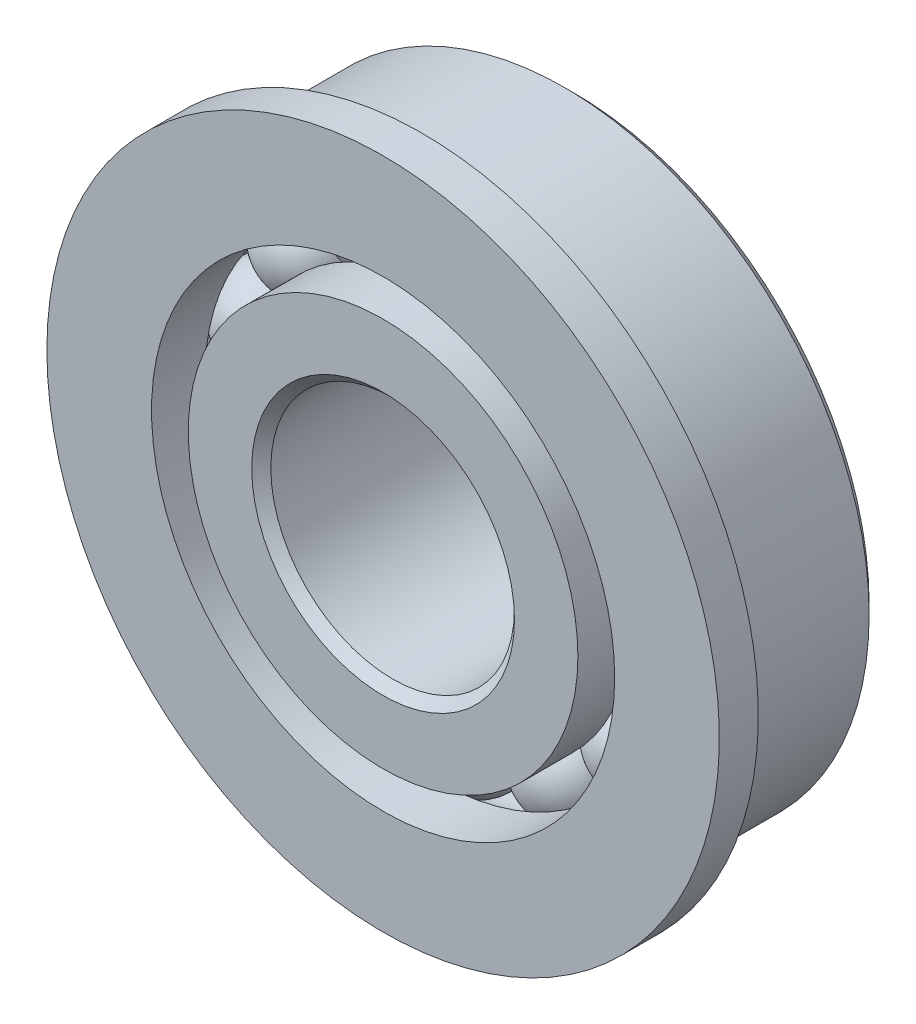
ISO-10303-21;
HEADER;
FILE_DESCRIPTION(('STEP AP214'),'2;1');
FILE_NAME('part.step','',(''),(''),'','','');
FILE_SCHEMA(('AUTOMOTIVE_DESIGN { 1 0 10303 214 1 1 1 1 }'));
ENDSEC;
DATA;
#1=APPLICATION_CONTEXT('core data for automotive mechanical design processes');
#2=APPLICATION_PROTOCOL_DEFINITION('international standard','automotive_design',2000,#1);
#3=PRODUCT_CONTEXT('',#1,'mechanical');
#4=PRODUCT('Part','Part','',(#3));
#5=PRODUCT_RELATED_PRODUCT_CATEGORY('part','',(#4));
#6=PRODUCT_DEFINITION_FORMATION('','',#4);
#7=PRODUCT_DEFINITION_CONTEXT('part definition',#1,'design');
#8=PRODUCT_DEFINITION('design','',#6,#7);
#9=PRODUCT_DEFINITION_SHAPE('','',#8);
#10=(LENGTH_UNIT() NAMED_UNIT(*) SI_UNIT(.MILLI.,.METRE.));
#11=(NAMED_UNIT(*) PLANE_ANGLE_UNIT() SI_UNIT($,.RADIAN.));
#12=(NAMED_UNIT(*) SI_UNIT($,.STERADIAN.) SOLID_ANGLE_UNIT());
#13=UNCERTAINTY_MEASURE_WITH_UNIT(LENGTH_MEASURE(1.E-05),#10,'distance_accuracy_value','');
#14=(GEOMETRIC_REPRESENTATION_CONTEXT(3) GLOBAL_UNCERTAINTY_ASSIGNED_CONTEXT((#13)) GLOBAL_UNIT_ASSIGNED_CONTEXT((#10,
#11,#12)) REPRESENTATION_CONTEXT('',''));
#15=CARTESIAN_POINT('',(0.,0.,0.));
#16=DIRECTION('',(0.,0.,1.));
#17=DIRECTION('',(1.,0.,0.));
#18=AXIS2_PLACEMENT_3D('',#15,#16,#17);
#19=CARTESIAN_POINT('',(2.41076652547194,5.00600827228281,0.));
#20=DIRECTION('',(0.,0.,-1.));
#21=DIRECTION('',(0.433883739117559,0.900968867902419,0.));
#22=AXIS2_PLACEMENT_3D('',#19,#20,#21);
#23=SPHERICAL_SURFACE('',#22,1.20554465033679);
#24=CARTESIAN_POINT('',(2.41076652547194,5.00600827228281,-1.20554465033679));
#25=VERTEX_POINT('',#24);
#26=VERTEX_LOOP('',#25);
#27=FACE_BOUND('',#26,.T.);
#28=ADVANCED_FACE('F35',(#27),#23,.T.);
#29=CLOSED_SHELL('',(#28));
#30=MANIFOLD_SOLID_BREP('B2',#29);
#31=CARTESIAN_POINT('',(0.,5.55625,0.));
#32=DIRECTION('',(0.,0.,-1.));
#33=DIRECTION('',(0.,1.,0.));
#34=AXIS2_PLACEMENT_3D('',#31,#32,#33);
#35=SPHERICAL_SURFACE('',#34,1.20554465033679);
#36=CARTESIAN_POINT('',(0.,5.55625,-1.20554465033679));
#37=VERTEX_POINT('',#36);
#38=VERTEX_LOOP('',#37);
#39=FACE_BOUND('',#38,.T.);
#40=ADVANCED_FACE('F53',(#39),#35,.T.);
#41=CLOSED_SHELL('',(#40));
#42=MANIFOLD_SOLID_BREP('B6',#41);
#43=CARTESIAN_POINT('',(-2.41076652547187,5.00600827228285,0.));
#44=DIRECTION('',(0.,0.,-1.));
#45=DIRECTION('',(-0.433883739117546,0.900968867902425,0.));
#46=AXIS2_PLACEMENT_3D('',#43,#44,#45);
#47=SPHERICAL_SURFACE('',#46,1.20554465033679);
#48=CARTESIAN_POINT('',(-2.41076652547187,5.00600827228285,-1.20554465033679));
#49=VERTEX_POINT('',#48);
#50=VERTEX_LOOP('',#49);
#51=FACE_BOUND('',#50,.T.);
#52=ADVANCED_FACE('F71',(#51),#47,.T.);
#53=CLOSED_SHELL('',(#52));
#54=MANIFOLD_SOLID_BREP('B31',#53);
#55=CARTESIAN_POINT('',(-4.34405117446295,3.46426521157764,0.));
#56=DIRECTION('',(0.,0.,-1.));
#57=DIRECTION('',(-0.781831482468022,0.623489801858743,0.));
#58=AXIS2_PLACEMENT_3D('',#55,#56,#57);
#59=SPHERICAL_SURFACE('',#58,1.20554465033679);
#60=CARTESIAN_POINT('',(-4.34405117446295,3.46426521157764,-1.20554465033679));
#61=VERTEX_POINT('',#60);
#62=VERTEX_LOOP('',#61);
#63=FACE_BOUND('',#62,.T.);
#64=ADVANCED_FACE('F89',(#63),#59,.T.);
#65=CLOSED_SHELL('',(#64));
#66=MANIFOLD_SOLID_BREP('B49',#65);
#67=CARTESIAN_POINT('',(-5.41694321206024,1.23638193929483,0.));
#68=DIRECTION('',(0.,0.,-1.));
#69=DIRECTION('',(-0.974927912181821,0.222520933956325,0.));
#70=AXIS2_PLACEMENT_3D('',#67,#68,#69);
#71=SPHERICAL_SURFACE('',#70,1.20554465033679);
#72=CARTESIAN_POINT('',(-5.41694321206024,1.23638193929483,-1.20554465033679));
#73=VERTEX_POINT('',#72);
#74=VERTEX_LOOP('',#73);
#75=FACE_BOUND('',#74,.T.);
#76=ADVANCED_FACE('F107',(#75),#71,.T.);
#77=CLOSED_SHELL('',(#76));
#78=MANIFOLD_SOLID_BREP('B67',#77);
#79=CARTESIAN_POINT('',(-5.41694321206027,-1.23638193929472,0.));
#80=DIRECTION('',(0.,0.,-1.));
#81=DIRECTION('',(-0.974927912181826,-0.222520933956305,0.));
#82=AXIS2_PLACEMENT_3D('',#79,#80,#81);
#83=SPHERICAL_SURFACE('',#82,1.20554465033679);
#84=CARTESIAN_POINT('',(-5.41694321206027,-1.23638193929472,-1.20554465033679));
#85=VERTEX_POINT('',#84);
#86=VERTEX_LOOP('',#85);
#87=FACE_BOUND('',#86,.T.);
#88=ADVANCED_FACE('F125',(#87),#83,.T.);
#89=CLOSED_SHELL('',(#88));
#90=MANIFOLD_SOLID_BREP('B85',#89);
#91=CARTESIAN_POINT('',(-4.34405117446302,-3.46426521157755,0.));
#92=DIRECTION('',(0.,0.,-1.));
#93=DIRECTION('',(-0.781831482468035,-0.623489801858727,0.));
#94=AXIS2_PLACEMENT_3D('',#91,#92,#93);
#95=SPHERICAL_SURFACE('',#94,1.20554465033679);
#96=CARTESIAN_POINT('',(-4.34405117446302,-3.46426521157755,-1.20554465033679));
#97=VERTEX_POINT('',#96);
#98=VERTEX_LOOP('',#97);
#99=FACE_BOUND('',#98,.T.);
#100=ADVANCED_FACE('F143',(#99),#95,.T.);
#101=CLOSED_SHELL('',(#100));
#102=MANIFOLD_SOLID_BREP('B103',#101);
#103=CARTESIAN_POINT('',(-2.41076652547197,-5.0060082722828,0.));
#104=DIRECTION('',(0.,0.,-1.));
#105=DIRECTION('',(-0.433883739117565,-0.900968867902416,0.));
#106=AXIS2_PLACEMENT_3D('',#103,#104,#105);
#107=SPHERICAL_SURFACE('',#106,1.20554465033679);
#108=CARTESIAN_POINT('',(-2.41076652547197,-5.0060082722828,-1.20554465033679));
#109=VERTEX_POINT('',#108);
#110=VERTEX_LOOP('',#109);
#111=FACE_BOUND('',#110,.T.);
#112=ADVANCED_FACE('F163',(#111),#107,.T.);
#113=CLOSED_SHELL('',(#112));
#114=MANIFOLD_SOLID_BREP('B121',#113);
#115=CARTESIAN_POINT('',(0.,0.,-2.24028));
#116=DIRECTION('',(0.,0.,1.));
#117=DIRECTION('',(-1.,0.,0.));
#118=AXIS2_PLACEMENT_3D('',#115,#116,#117);
#119=CONICAL_SURFACE('',#118,7.9375,0.785398163397448);
#120=CARTESIAN_POINT('',(0.,0.,-2.4892));
#121=DIRECTION('',(0.,0.,1.));
#122=DIRECTION('',(1.,0.,0.));
#123=AXIS2_PLACEMENT_3D('',#120,#121,#122);
#124=CIRCLE('',#123,7.68858);
#125=CARTESIAN_POINT('',(7.68858,0.,-2.4892));
#126=VERTEX_POINT('',#125);
#127=EDGE_CURVE('E203',#126,#126,#124,.T.);
#128=ORIENTED_EDGE('',*,*,#127,.T.);
#129=EDGE_LOOP('',(#128));
#130=FACE_BOUND('',#129,.T.);
#131=CARTESIAN_POINT('',(0.,0.,-2.24028));
#132=DIRECTION('',(0.,0.,1.));
#133=DIRECTION('',(1.,0.,0.));
#134=AXIS2_PLACEMENT_3D('',#131,#132,#133);
#135=CIRCLE('',#134,7.9375);
#136=CARTESIAN_POINT('',(7.9375,0.,-2.24028));
#137=VERTEX_POINT('',#136);
#138=EDGE_CURVE('E162',#137,#137,#135,.T.);
#139=ORIENTED_EDGE('',*,*,#138,.F.);
#140=EDGE_LOOP('',(#139));
#141=FACE_BOUND('',#140,.T.);
#142=ADVANCED_FACE('F181',(#130,#141),#119,.T.);
#143=CARTESIAN_POINT('',(0.,0.,-2.4892));
#144=DIRECTION('',(0.,0.,-1.));
#145=DIRECTION('',(1.,0.,0.));
#146=AXIS2_PLACEMENT_3D('',#143,#144,#145);
#147=CYLINDRICAL_SURFACE('',#146,7.9375);
#148=CARTESIAN_POINT('',(0.,0.,1.4732));
#149=DIRECTION('',(0.,0.,1.));
#150=DIRECTION('',(1.,0.,0.));
#151=AXIS2_PLACEMENT_3D('',#148,#149,#150);
#152=CIRCLE('',#151,7.9375);
#153=CARTESIAN_POINT('',(7.9375,0.,1.4732));
#154=VERTEX_POINT('',#153);
#155=EDGE_CURVE('E184',#154,#154,#152,.T.);
#156=ORIENTED_EDGE('',*,*,#155,.F.);
#157=EDGE_LOOP('',(#156));
#158=FACE_BOUND('',#157,.T.);
#159=ORIENTED_EDGE('',*,*,#138,.T.);
#160=EDGE_LOOP('',(#159));
#161=FACE_BOUND('',#160,.T.);
#162=ADVANCED_FACE('F225',(#158,#161),#147,.T.);
#163=CARTESIAN_POINT('',(0.,7.68858,2.4892));
#164=DIRECTION('',(0.,0.,-1.));
#165=DIRECTION('',(1.,0.,0.));
#166=AXIS2_PLACEMENT_3D('',#163,#164,#165);
#167=PLANE('',#166);
#168=CARTESIAN_POINT('',(0.,0.,2.4892));
#169=DIRECTION('',(0.,0.,1.));
#170=DIRECTION('',(1.,0.,0.));
#171=AXIS2_PLACEMENT_3D('',#168,#169,#170);
#172=CIRCLE('',#171,6.03522142857143);
#173=CARTESIAN_POINT('',(6.03522142857143,0.,2.4892));
#174=VERTEX_POINT('',#173);
#175=EDGE_CURVE('E188',#174,#174,#172,.T.);
#176=ORIENTED_EDGE('',*,*,#175,.F.);
#177=EDGE_LOOP('',(#176));
#178=FACE_BOUND('',#177,.T.);
#179=CARTESIAN_POINT('',(0.,0.,2.4892));
#180=DIRECTION('',(0.,0.,-1.));
#181=DIRECTION('',(-1.,0.,0.));
#182=AXIS2_PLACEMENT_3D('',#179,#180,#181);
#183=CIRCLE('',#182,8.763);
#184=CARTESIAN_POINT('',(-8.763,0.,2.4892));
#185=VERTEX_POINT('',#184);
#186=EDGE_CURVE('E206',#185,#185,#183,.T.);
#187=ORIENTED_EDGE('',*,*,#186,.F.);
#188=EDGE_LOOP('',(#187));
#189=FACE_BOUND('',#188,.T.);
#190=ADVANCED_FACE('F222',(#178,#189),#167,.F.);
#191=CARTESIAN_POINT('',(0.,0.,-2.4892));
#192=DIRECTION('',(0.,0.,-1.));
#193=DIRECTION('',(1.,0.,0.));
#194=AXIS2_PLACEMENT_3D('',#191,#192,#193);
#195=CYLINDRICAL_SURFACE('',#194,6.03522142857143);
#196=ORIENTED_EDGE('',*,*,#175,.T.);
#197=EDGE_LOOP('',(#196));
#198=FACE_BOUND('',#197,.T.);
#199=CARTESIAN_POINT('',(0.,0.,1.10631111111111));
#200=DIRECTION('',(0.,0.,1.));
#201=DIRECTION('',(1.,0.,0.));
#202=AXIS2_PLACEMENT_3D('',#199,#200,#201);
#203=CIRCLE('',#202,6.03522142857143);
#204=CARTESIAN_POINT('',(6.03522142857143,0.,1.10631111111111));
#205=VERTEX_POINT('',#204);
#206=EDGE_CURVE('E192',#205,#205,#203,.T.);
#207=ORIENTED_EDGE('',*,*,#206,.F.);
#208=EDGE_LOOP('',(#207));
#209=FACE_BOUND('',#208,.T.);
#210=ADVANCED_FACE('F224',(#198,#209),#195,.F.);
#211=CARTESIAN_POINT('',(0.,0.,0.));
#212=DIRECTION('',(0.,0.,-1.));
#213=DIRECTION('',(1.,0.,0.));
#214=AXIS2_PLACEMENT_3D('',#211,#212,#213);
#215=TOROIDAL_SURFACE('',#214,5.55625,1.20554465033679);
#216=ORIENTED_EDGE('',*,*,#206,.T.);
#217=EDGE_LOOP('',(#216));
#218=FACE_BOUND('',#217,.T.);
#219=CARTESIAN_POINT('',(0.,0.,-1.10631111111111));
#220=DIRECTION('',(0.,0.,1.));
#221=DIRECTION('',(1.,0.,0.));
#222=AXIS2_PLACEMENT_3D('',#219,#220,#221);
#223=CIRCLE('',#222,6.03522142857143);
#224=CARTESIAN_POINT('',(6.03522142857143,0.,-1.10631111111111));
#225=VERTEX_POINT('',#224);
#226=EDGE_CURVE('E197',#225,#225,#223,.T.);
#227=ORIENTED_EDGE('',*,*,#226,.F.);
#228=EDGE_LOOP('',(#227));
#229=FACE_BOUND('',#228,.T.);
#230=ADVANCED_FACE('F232',(#218,#229),#215,.F.);
#231=CARTESIAN_POINT('',(0.,0.,-2.4892));
#232=DIRECTION('',(0.,0.,-1.));
#233=DIRECTION('',(1.,0.,0.));
#234=AXIS2_PLACEMENT_3D('',#231,#232,#233);
#235=CYLINDRICAL_SURFACE('',#234,6.03522142857143);
#236=ORIENTED_EDGE('',*,*,#226,.T.);
#237=EDGE_LOOP('',(#236));
#238=FACE_BOUND('',#237,.T.);
#239=CARTESIAN_POINT('',(0.,0.,-2.4892));
#240=DIRECTION('',(0.,0.,1.));
#241=DIRECTION('',(1.,0.,0.));
#242=AXIS2_PLACEMENT_3D('',#239,#240,#241);
#243=CIRCLE('',#242,6.03522142857143);
#244=CARTESIAN_POINT('',(6.03522142857143,0.,-2.4892));
#245=VERTEX_POINT('',#244);
#246=EDGE_CURVE('E200',#245,#245,#243,.T.);
#247=ORIENTED_EDGE('',*,*,#246,.F.);
#248=EDGE_LOOP('',(#247));
#249=FACE_BOUND('',#248,.T.);
#250=ADVANCED_FACE('F246',(#238,#249),#235,.F.);
#251=CARTESIAN_POINT('',(0.,7.68858,-2.4892));
#252=DIRECTION('',(0.,0.,1.));
#253=DIRECTION('',(-1.,0.,0.));
#254=AXIS2_PLACEMENT_3D('',#251,#252,#253);
#255=PLANE('',#254);
#256=ORIENTED_EDGE('',*,*,#246,.T.);
#257=EDGE_LOOP('',(#256));
#258=FACE_BOUND('',#257,.T.);
#259=ORIENTED_EDGE('',*,*,#127,.F.);
#260=EDGE_LOOP('',(#259));
#261=FACE_BOUND('',#260,.T.);
#262=ADVANCED_FACE('F244',(#258,#261),#255,.F.);
#263=CARTESIAN_POINT('',(0.,6.86190071428571,1.4732));
#264=DIRECTION('',(0.,0.,-1.));
#265=DIRECTION('',(1.,0.,0.));
#266=AXIS2_PLACEMENT_3D('',#263,#264,#265);
#267=PLANE('',#266);
#268=CARTESIAN_POINT('',(0.,0.,1.4732));
#269=DIRECTION('',(0.,0.,-1.));
#270=DIRECTION('',(-1.,0.,0.));
#271=AXIS2_PLACEMENT_3D('',#268,#269,#270);
#272=CIRCLE('',#271,8.763);
#273=CARTESIAN_POINT('',(-8.763,0.,1.4732));
#274=VERTEX_POINT('',#273);
#275=EDGE_CURVE('E209',#274,#274,#272,.T.);
#276=ORIENTED_EDGE('',*,*,#275,.T.);
#277=EDGE_LOOP('',(#276));
#278=FACE_BOUND('',#277,.T.);
#279=ORIENTED_EDGE('',*,*,#155,.T.);
#280=EDGE_LOOP('',(#279));
#281=FACE_BOUND('',#280,.T.);
#282=ADVANCED_FACE('F213',(#278,#281),#267,.T.);
#283=CARTESIAN_POINT('',(0.,0.,2.4892));
#284=DIRECTION('',(0.,0.,1.));
#285=DIRECTION('',(-1.,0.,0.));
#286=AXIS2_PLACEMENT_3D('',#283,#284,#285);
#287=CYLINDRICAL_SURFACE('',#286,8.763);
#288=ORIENTED_EDGE('',*,*,#275,.F.);
#289=EDGE_LOOP('',(#288));
#290=FACE_BOUND('',#289,.T.);
#291=ORIENTED_EDGE('',*,*,#186,.T.);
#292=EDGE_LOOP('',(#291));
#293=FACE_BOUND('',#292,.T.);
#294=ADVANCED_FACE('F216',(#290,#293),#287,.T.);
#295=CLOSED_SHELL('',(#142,#162,#190,#210,#230,#250,#262,#282,#294));
#296=MANIFOLD_SOLID_BREP('B139',#295);
#297=CARTESIAN_POINT('',(0.,-5.55625,0.));
#298=DIRECTION('',(0.,0.,-1.));
#299=DIRECTION('',(0.,-1.,0.));
#300=AXIS2_PLACEMENT_3D('',#297,#298,#299);
#301=SPHERICAL_SURFACE('',#300,1.20554465033679);
#302=CARTESIAN_POINT('',(0.,-5.55625,-1.20554465033679));
#303=VERTEX_POINT('',#302);
#304=VERTEX_LOOP('',#303);
#305=FACE_BOUND('',#304,.T.);
#306=ADVANCED_FACE('F326',(#305),#301,.T.);
#307=CLOSED_SHELL('',(#306));
#308=MANIFOLD_SOLID_BREP('B157',#307);
#309=CARTESIAN_POINT('',(2.4107665254719,-5.00600827228283,0.));
#310=DIRECTION('',(0.,0.,-1.));
#311=DIRECTION('',(0.433883739117553,-0.900968867902422,0.));
#312=AXIS2_PLACEMENT_3D('',#309,#310,#311);
#313=SPHERICAL_SURFACE('',#312,1.20554465033679);
#314=CARTESIAN_POINT('',(2.4107665254719,-5.00600827228283,-1.20554465033679));
#315=VERTEX_POINT('',#314);
#316=VERTEX_LOOP('',#315);
#317=FACE_BOUND('',#316,.T.);
#318=ADVANCED_FACE('F344',(#317),#313,.T.);
#319=CLOSED_SHELL('',(#318));
#320=MANIFOLD_SOLID_BREP('B177',#319);
#321=CARTESIAN_POINT('',(4.34405117446297,-3.46426521157761,0.));
#322=DIRECTION('',(0.,0.,-1.));
#323=DIRECTION('',(0.781831482468027,-0.623489801858737,0.));
#324=AXIS2_PLACEMENT_3D('',#321,#322,#323);
#325=SPHERICAL_SURFACE('',#324,1.20554465033679);
#326=CARTESIAN_POINT('',(4.34405117446297,-3.46426521157761,-1.20554465033679));
#327=VERTEX_POINT('',#326);
#328=VERTEX_LOOP('',#327);
#329=FACE_BOUND('',#328,.T.);
#330=ADVANCED_FACE('F362',(#329),#325,.T.);
#331=CLOSED_SHELL('',(#330));
#332=MANIFOLD_SOLID_BREP('B322',#331);
#333=CARTESIAN_POINT('',(5.41694321206025,-1.23638193929479,0.));
#334=DIRECTION('',(0.,0.,-1.));
#335=DIRECTION('',(0.974927912181823,-0.222520933956318,0.));
#336=AXIS2_PLACEMENT_3D('',#333,#334,#335);
#337=SPHERICAL_SURFACE('',#336,1.20554465033679);
#338=CARTESIAN_POINT('',(5.41694321206025,-1.23638193929479,-1.20554465033679));
#339=VERTEX_POINT('',#338);
#340=VERTEX_LOOP('',#339);
#341=FACE_BOUND('',#340,.T.);
#342=ADVANCED_FACE('F380',(#341),#337,.T.);
#343=CLOSED_SHELL('',(#342));
#344=MANIFOLD_SOLID_BREP('B340',#343);
#345=CARTESIAN_POINT('',(5.41694321206026,1.23638193929476,0.));
#346=DIRECTION('',(0.,0.,-1.));
#347=DIRECTION('',(0.974927912181824,0.222520933956311,0.));
#348=AXIS2_PLACEMENT_3D('',#345,#346,#347);
#349=SPHERICAL_SURFACE('',#348,1.20554465033679);
#350=CARTESIAN_POINT('',(5.41694321206026,1.23638193929476,-1.20554465033679));
#351=VERTEX_POINT('',#350);
#352=VERTEX_LOOP('',#351);
#353=FACE_BOUND('',#352,.T.);
#354=ADVANCED_FACE('F400',(#353),#349,.T.);
#355=CLOSED_SHELL('',(#354));
#356=MANIFOLD_SOLID_BREP('B358',#355);
#357=CARTESIAN_POINT('',(0.,5.07727857142857,-2.4892));
#358=DIRECTION('',(0.,0.,1.));
#359=DIRECTION('',(-1.,0.,0.));
#360=AXIS2_PLACEMENT_3D('',#357,#358,#359);
#361=PLANE('',#360);
#362=CARTESIAN_POINT('',(0.,0.,-2.4892));
#363=DIRECTION('',(0.,0.,1.));
#364=DIRECTION('',(1.,0.,0.));
#365=AXIS2_PLACEMENT_3D('',#362,#363,#364);
#366=CIRCLE('',#365,3.42392);
#367=CARTESIAN_POINT('',(3.42392,0.,-2.4892));
#368=VERTEX_POINT('',#367);
#369=EDGE_CURVE('E445',#368,#368,#366,.T.);
#370=ORIENTED_EDGE('',*,*,#369,.T.);
#371=EDGE_LOOP('',(#370));
#372=FACE_BOUND('',#371,.T.);
#373=CARTESIAN_POINT('',(0.,0.,-2.4892));
#374=DIRECTION('',(0.,0.,1.));
#375=DIRECTION('',(1.,0.,0.));
#376=AXIS2_PLACEMENT_3D('',#373,#374,#375);
#377=CIRCLE('',#376,5.07727857142857);
#378=CARTESIAN_POINT('',(5.07727857142857,0.,-2.4892));
#379=VERTEX_POINT('',#378);
#380=EDGE_CURVE('E399',#379,#379,#377,.T.);
#381=ORIENTED_EDGE('',*,*,#380,.F.);
#382=EDGE_LOOP('',(#381));
#383=FACE_BOUND('',#382,.T.);
#384=ADVANCED_FACE('F417',(#372,#383),#361,.F.);
#385=CARTESIAN_POINT('',(0.,0.,-2.4892));
#386=DIRECTION('',(0.,0.,-1.));
#387=DIRECTION('',(1.,0.,0.));
#388=AXIS2_PLACEMENT_3D('',#385,#386,#387);
#389=CYLINDRICAL_SURFACE('',#388,5.07727857142857);
#390=ORIENTED_EDGE('',*,*,#380,.T.);
#391=EDGE_LOOP('',(#390));
#392=FACE_BOUND('',#391,.T.);
#393=CARTESIAN_POINT('',(0.,0.,-1.10631111111111));
#394=DIRECTION('',(0.,0.,1.));
#395=DIRECTION('',(1.,0.,0.));
#396=AXIS2_PLACEMENT_3D('',#393,#394,#395);
#397=CIRCLE('',#396,5.07727857142857);
#398=CARTESIAN_POINT('',(5.07727857142857,0.,-1.10631111111111));
#399=VERTEX_POINT('',#398);
#400=EDGE_CURVE('E423',#399,#399,#397,.T.);
#401=ORIENTED_EDGE('',*,*,#400,.F.);
#402=EDGE_LOOP('',(#401));
#403=FACE_BOUND('',#402,.T.);
#404=ADVANCED_FACE('F463',(#392,#403),#389,.T.);
#405=CARTESIAN_POINT('',(0.,0.,0.));
#406=DIRECTION('',(0.,0.,-1.));
#407=DIRECTION('',(1.,0.,0.));
#408=AXIS2_PLACEMENT_3D('',#405,#406,#407);
#409=TOROIDAL_SURFACE('',#408,5.55625,1.20554465033679);
#410=ORIENTED_EDGE('',*,*,#400,.T.);
#411=EDGE_LOOP('',(#410));
#412=FACE_BOUND('',#411,.T.);
#413=CARTESIAN_POINT('',(0.,0.,1.10631111111111));
#414=DIRECTION('',(0.,0.,1.));
#415=DIRECTION('',(1.,0.,0.));
#416=AXIS2_PLACEMENT_3D('',#413,#414,#415);
#417=CIRCLE('',#416,5.07727857142857);
#418=CARTESIAN_POINT('',(5.07727857142857,0.,1.10631111111111));
#419=VERTEX_POINT('',#418);
#420=EDGE_CURVE('E427',#419,#419,#417,.T.);
#421=ORIENTED_EDGE('',*,*,#420,.F.);
#422=EDGE_LOOP('',(#421));
#423=FACE_BOUND('',#422,.T.);
#424=ADVANCED_FACE('F467',(#412,#423),#409,.F.);
#425=CARTESIAN_POINT('',(0.,0.,-2.4892));
#426=DIRECTION('',(0.,0.,-1.));
#427=DIRECTION('',(1.,0.,0.));
#428=AXIS2_PLACEMENT_3D('',#425,#426,#427);
#429=CYLINDRICAL_SURFACE('',#428,5.07727857142857);
#430=ORIENTED_EDGE('',*,*,#420,.T.);
#431=EDGE_LOOP('',(#430));
#432=FACE_BOUND('',#431,.T.);
#433=CARTESIAN_POINT('',(0.,0.,2.4892));
#434=DIRECTION('',(0.,0.,1.));
#435=DIRECTION('',(1.,0.,0.));
#436=AXIS2_PLACEMENT_3D('',#433,#434,#435);
#437=CIRCLE('',#436,5.07727857142857);
#438=CARTESIAN_POINT('',(5.07727857142857,0.,2.4892));
#439=VERTEX_POINT('',#438);
#440=EDGE_CURVE('E431',#439,#439,#437,.T.);
#441=ORIENTED_EDGE('',*,*,#440,.F.);
#442=EDGE_LOOP('',(#441));
#443=FACE_BOUND('',#442,.T.);
#444=ADVANCED_FACE('F471',(#432,#443),#429,.T.);
#445=CARTESIAN_POINT('',(0.,3.42392,2.4892));
#446=DIRECTION('',(0.,0.,-1.));
#447=DIRECTION('',(1.,0.,0.));
#448=AXIS2_PLACEMENT_3D('',#445,#446,#447);
#449=PLANE('',#448);
#450=ORIENTED_EDGE('',*,*,#440,.T.);
#451=EDGE_LOOP('',(#450));
#452=FACE_BOUND('',#451,.T.);
#453=CARTESIAN_POINT('',(0.,0.,2.4892));
#454=DIRECTION('',(0.,0.,1.));
#455=DIRECTION('',(1.,0.,0.));
#456=AXIS2_PLACEMENT_3D('',#453,#454,#455);
#457=CIRCLE('',#456,3.42392);
#458=CARTESIAN_POINT('',(3.42392,0.,2.4892));
#459=VERTEX_POINT('',#458);
#460=EDGE_CURVE('E436',#459,#459,#457,.T.);
#461=ORIENTED_EDGE('',*,*,#460,.F.);
#462=EDGE_LOOP('',(#461));
#463=FACE_BOUND('',#462,.T.);
#464=ADVANCED_FACE('F477',(#452,#463),#449,.F.);
#465=CARTESIAN_POINT('',(0.,0.,2.24028));
#466=DIRECTION('',(0.,0.,1.));
#467=DIRECTION('',(-1.,0.,0.));
#468=AXIS2_PLACEMENT_3D('',#465,#466,#467);
#469=CONICAL_SURFACE('',#468,3.175,0.785398163397447);
#470=ORIENTED_EDGE('',*,*,#460,.T.);
#471=EDGE_LOOP('',(#470));
#472=FACE_BOUND('',#471,.T.);
#473=CARTESIAN_POINT('',(0.,0.,2.24028));
#474=DIRECTION('',(0.,0.,1.));
#475=DIRECTION('',(1.,0.,0.));
#476=AXIS2_PLACEMENT_3D('',#473,#474,#475);
#477=CIRCLE('',#476,3.175);
#478=CARTESIAN_POINT('',(3.175,0.,2.24028));
#479=VERTEX_POINT('',#478);
#480=EDGE_CURVE('E439',#479,#479,#477,.T.);
#481=ORIENTED_EDGE('',*,*,#480,.F.);
#482=EDGE_LOOP('',(#481));
#483=FACE_BOUND('',#482,.T.);
#484=ADVANCED_FACE('F459',(#472,#483),#469,.F.);
#485=CARTESIAN_POINT('',(0.,0.,-2.4892));
#486=DIRECTION('',(0.,0.,-1.));
#487=DIRECTION('',(1.,0.,0.));
#488=AXIS2_PLACEMENT_3D('',#485,#486,#487);
#489=CYLINDRICAL_SURFACE('',#488,3.175);
#490=ORIENTED_EDGE('',*,*,#480,.T.);
#491=EDGE_LOOP('',(#490));
#492=FACE_BOUND('',#491,.T.);
#493=CARTESIAN_POINT('',(0.,0.,-2.24028));
#494=DIRECTION('',(0.,0.,1.));
#495=DIRECTION('',(1.,0.,0.));
#496=AXIS2_PLACEMENT_3D('',#493,#494,#495);
#497=CIRCLE('',#496,3.175);
#498=CARTESIAN_POINT('',(3.175,0.,-2.24028));
#499=VERTEX_POINT('',#498);
#500=EDGE_CURVE('E442',#499,#499,#497,.T.);
#501=ORIENTED_EDGE('',*,*,#500,.F.);
#502=EDGE_LOOP('',(#501));
#503=FACE_BOUND('',#502,.T.);
#504=ADVANCED_FACE('F453',(#492,#503),#489,.F.);
#505=CARTESIAN_POINT('',(0.,0.,-2.4892));
#506=DIRECTION('',(0.,0.,-1.));
#507=DIRECTION('',(1.,0.,0.));
#508=AXIS2_PLACEMENT_3D('',#505,#506,#507);
#509=CONICAL_SURFACE('',#508,3.42392,0.785398163397448);
#510=ORIENTED_EDGE('',*,*,#500,.T.);
#511=EDGE_LOOP('',(#510));
#512=FACE_BOUND('',#511,.T.);
#513=ORIENTED_EDGE('',*,*,#369,.F.);
#514=EDGE_LOOP('',(#513));
#515=FACE_BOUND('',#514,.T.);
#516=ADVANCED_FACE('F451',(#512,#515),#509,.F.);
#517=CLOSED_SHELL('',(#384,#404,#424,#444,#464,#484,#504,#516));
#518=MANIFOLD_SOLID_BREP('B376',#517);
#519=CARTESIAN_POINT('',(4.344051174463,3.46426521157758,0.));
#520=DIRECTION('',(0.,0.,-1.));
#521=DIRECTION('',(0.781831482468031,0.623489801858732,0.));
#522=AXIS2_PLACEMENT_3D('',#519,#520,#521);
#523=SPHERICAL_SURFACE('',#522,1.20554465033679);
#524=CARTESIAN_POINT('',(4.344051174463,3.46426521157758,-1.20554465033679));
#525=VERTEX_POINT('',#524);
#526=VERTEX_LOOP('',#525);
#527=FACE_BOUND('',#526,.T.);
#528=ADVANCED_FACE('F538',(#527),#523,.T.);
#529=CLOSED_SHELL('',(#528));
#530=MANIFOLD_SOLID_BREP('B394',#529);
#531=ADVANCED_BREP_SHAPE_REPRESENTATION('',(#18,#30,#42,#54,#66,#78,#90,#102,#114,#296,#308,
#320,#332,#344,#356,#518,#530),#14);
#532=SHAPE_DEFINITION_REPRESENTATION(#9,#531);
ENDSEC;
END-ISO-10303-21;
